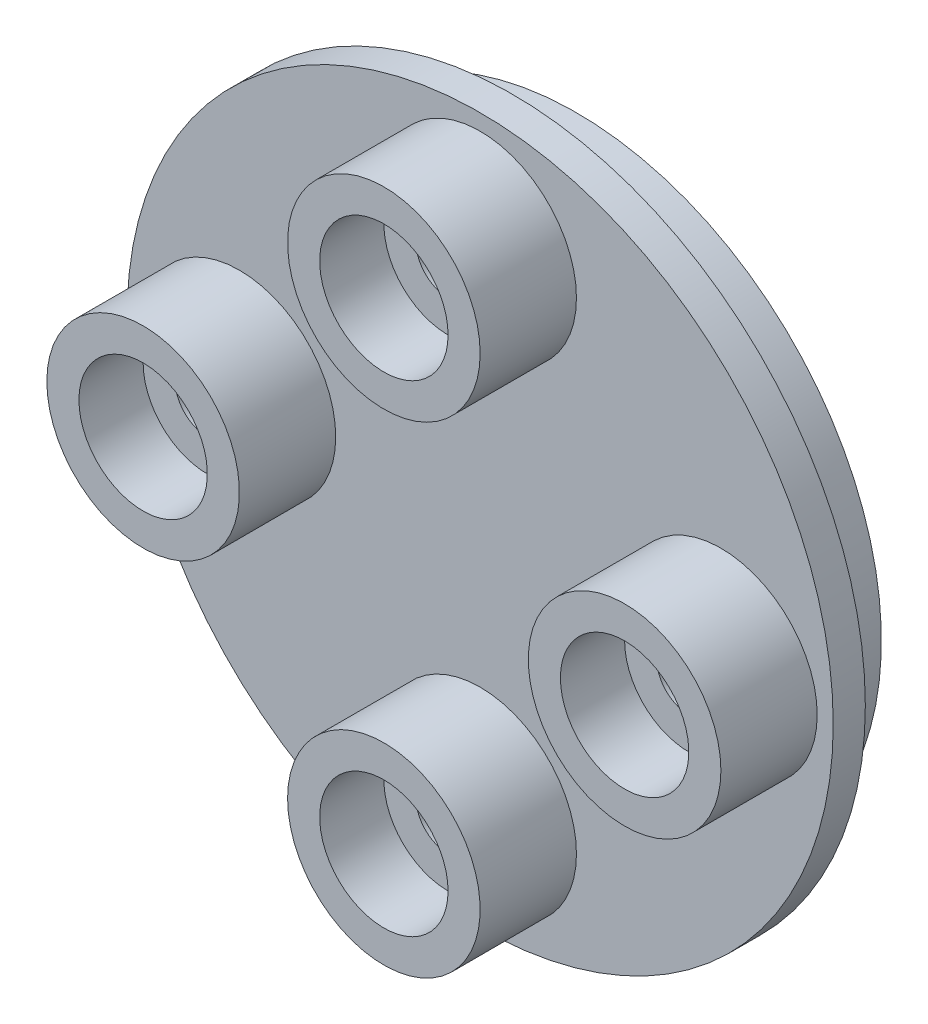
ISO-10303-21;
HEADER;
FILE_DESCRIPTION(('STEP AP214'),'2;1');
FILE_NAME('part.step','',(''),(''),'','','');
FILE_SCHEMA(('AUTOMOTIVE_DESIGN { 1 0 10303 214 1 1 1 1 }'));
ENDSEC;
DATA;
#1=APPLICATION_CONTEXT('core data for automotive mechanical design processes');
#2=APPLICATION_PROTOCOL_DEFINITION('international standard','automotive_design',2000,#1);
#3=PRODUCT_CONTEXT('',#1,'mechanical');
#4=PRODUCT('Part','Part','',(#3));
#5=PRODUCT_RELATED_PRODUCT_CATEGORY('part','',(#4));
#6=PRODUCT_DEFINITION_FORMATION('','',#4);
#7=PRODUCT_DEFINITION_CONTEXT('part definition',#1,'design');
#8=PRODUCT_DEFINITION('design','',#6,#7);
#9=PRODUCT_DEFINITION_SHAPE('','',#8);
#10=(LENGTH_UNIT() NAMED_UNIT(*) SI_UNIT(.MILLI.,.METRE.));
#11=(NAMED_UNIT(*) PLANE_ANGLE_UNIT() SI_UNIT($,.RADIAN.));
#12=(NAMED_UNIT(*) SI_UNIT($,.STERADIAN.) SOLID_ANGLE_UNIT());
#13=UNCERTAINTY_MEASURE_WITH_UNIT(LENGTH_MEASURE(1.E-05),#10,'distance_accuracy_value','');
#14=(GEOMETRIC_REPRESENTATION_CONTEXT(3) GLOBAL_UNCERTAINTY_ASSIGNED_CONTEXT((#13)) GLOBAL_UNIT_ASSIGNED_CONTEXT((#10,
#11,#12)) REPRESENTATION_CONTEXT('',''));
#15=CARTESIAN_POINT('',(0.,0.,0.));
#16=DIRECTION('',(0.,0.,1.));
#17=DIRECTION('',(1.,0.,0.));
#18=AXIS2_PLACEMENT_3D('',#15,#16,#17);
#19=CARTESIAN_POINT('',(0.,7.5,4.));
#20=DIRECTION('',(0.,0.,-1.));
#21=DIRECTION('',(-1.,0.,0.));
#22=AXIS2_PLACEMENT_3D('',#19,#20,#21);
#23=CYLINDRICAL_SURFACE('',#22,3.);
#24=CARTESIAN_POINT('',(0.,7.5,1.));
#25=DIRECTION('',(0.,0.,1.));
#26=DIRECTION('',(1.,0.,0.));
#27=AXIS2_PLACEMENT_3D('',#24,#25,#26);
#28=CIRCLE('',#27,3.);
#29=CARTESIAN_POINT('',(3.,7.5,1.));
#30=VERTEX_POINT('',#29);
#31=EDGE_CURVE('E69',#30,#30,#28,.T.);
#32=ORIENTED_EDGE('',*,*,#31,.T.);
#33=EDGE_LOOP('',(#32));
#34=FACE_BOUND('',#33,.T.);
#35=CARTESIAN_POINT('',(0.,7.5,4.));
#36=DIRECTION('',(0.,0.,1.));
#37=DIRECTION('',(1.,0.,0.));
#38=AXIS2_PLACEMENT_3D('',#35,#36,#37);
#39=CIRCLE('',#38,3.);
#40=CARTESIAN_POINT('',(3.,7.5,4.));
#41=VERTEX_POINT('',#40);
#42=EDGE_CURVE('E58',#41,#41,#39,.T.);
#43=ORIENTED_EDGE('',*,*,#42,.F.);
#44=EDGE_LOOP('',(#43));
#45=FACE_BOUND('',#44,.T.);
#46=ADVANCED_FACE('F38',(#34,#45),#23,.T.);
#47=CARTESIAN_POINT('',(0.,7.5,4.));
#48=DIRECTION('',(0.,0.,1.));
#49=DIRECTION('',(1.,0.,0.));
#50=AXIS2_PLACEMENT_3D('',#47,#48,#49);
#51=PLANE('',#50);
#52=CARTESIAN_POINT('',(0.,7.5,4.));
#53=DIRECTION('',(0.,0.,1.));
#54=DIRECTION('',(1.,0.,0.));
#55=AXIS2_PLACEMENT_3D('',#52,#53,#54);
#56=CIRCLE('',#55,2.);
#57=CARTESIAN_POINT('',(2.,7.5,4.));
#58=VERTEX_POINT('',#57);
#59=EDGE_CURVE('E105',#58,#58,#56,.T.);
#60=ORIENTED_EDGE('',*,*,#59,.F.);
#61=EDGE_LOOP('',(#60));
#62=FACE_BOUND('',#61,.T.);
#63=ORIENTED_EDGE('',*,*,#42,.T.);
#64=EDGE_LOOP('',(#63));
#65=FACE_BOUND('',#64,.T.);
#66=ADVANCED_FACE('F176',(#62,#65),#51,.T.);
#67=CARTESIAN_POINT('',(0.,0.,1.));
#68=DIRECTION('',(0.,0.,-1.));
#69=DIRECTION('',(-1.,0.,0.));
#70=AXIS2_PLACEMENT_3D('',#67,#68,#69);
#71=CYLINDRICAL_SURFACE('',#70,11.);
#72=CARTESIAN_POINT('',(0.,0.,1.));
#73=DIRECTION('',(0.,0.,1.));
#74=DIRECTION('',(1.,0.,0.));
#75=AXIS2_PLACEMENT_3D('',#72,#73,#74);
#76=CIRCLE('',#75,11.);
#77=CARTESIAN_POINT('',(11.,0.,1.));
#78=VERTEX_POINT('',#77);
#79=EDGE_CURVE('E61',#78,#78,#76,.T.);
#80=ORIENTED_EDGE('',*,*,#79,.F.);
#81=EDGE_LOOP('',(#80));
#82=FACE_BOUND('',#81,.T.);
#83=CARTESIAN_POINT('',(0.,0.,0.));
#84=DIRECTION('',(0.,0.,1.));
#85=DIRECTION('',(1.,0.,0.));
#86=AXIS2_PLACEMENT_3D('',#83,#84,#85);
#87=CIRCLE('',#86,11.);
#88=CARTESIAN_POINT('',(11.,0.,0.));
#89=VERTEX_POINT('',#88);
#90=EDGE_CURVE('E62',#89,#89,#87,.T.);
#91=ORIENTED_EDGE('',*,*,#90,.T.);
#92=EDGE_LOOP('',(#91));
#93=FACE_BOUND('',#92,.T.);
#94=ADVANCED_FACE('F182',(#82,#93),#71,.T.);
#95=CARTESIAN_POINT('',(0.,0.,1.));
#96=DIRECTION('',(0.,0.,1.));
#97=DIRECTION('',(1.,0.,0.));
#98=AXIS2_PLACEMENT_3D('',#95,#96,#97);
#99=PLANE('',#98);
#100=CARTESIAN_POINT('',(7.5,0.,1.));
#101=DIRECTION('',(0.,0.,1.));
#102=DIRECTION('',(1.,0.,0.));
#103=AXIS2_PLACEMENT_3D('',#100,#101,#102);
#104=CIRCLE('',#103,3.);
#105=CARTESIAN_POINT('',(10.5,0.,1.));
#106=VERTEX_POINT('',#105);
#107=EDGE_CURVE('E65',#106,#106,#104,.T.);
#108=ORIENTED_EDGE('',*,*,#107,.F.);
#109=EDGE_LOOP('',(#108));
#110=FACE_BOUND('',#109,.T.);
#111=CARTESIAN_POINT('',(0.,-7.5,1.));
#112=DIRECTION('',(0.,0.,1.));
#113=DIRECTION('',(1.,0.,0.));
#114=AXIS2_PLACEMENT_3D('',#111,#112,#113);
#115=CIRCLE('',#114,3.);
#116=CARTESIAN_POINT('',(3.,-7.5,1.));
#117=VERTEX_POINT('',#116);
#118=EDGE_CURVE('E79',#117,#117,#115,.T.);
#119=ORIENTED_EDGE('',*,*,#118,.F.);
#120=EDGE_LOOP('',(#119));
#121=FACE_BOUND('',#120,.T.);
#122=CARTESIAN_POINT('',(-7.5,0.,1.));
#123=DIRECTION('',(0.,0.,1.));
#124=DIRECTION('',(1.,0.,0.));
#125=AXIS2_PLACEMENT_3D('',#122,#123,#124);
#126=CIRCLE('',#125,3.);
#127=CARTESIAN_POINT('',(-4.5,0.,1.));
#128=VERTEX_POINT('',#127);
#129=EDGE_CURVE('E66',#128,#128,#126,.T.);
#130=ORIENTED_EDGE('',*,*,#129,.F.);
#131=EDGE_LOOP('',(#130));
#132=FACE_BOUND('',#131,.T.);
#133=ORIENTED_EDGE('',*,*,#31,.F.);
#134=EDGE_LOOP('',(#133));
#135=FACE_BOUND('',#134,.T.);
#136=ORIENTED_EDGE('',*,*,#79,.T.);
#137=EDGE_LOOP('',(#136));
#138=FACE_BOUND('',#137,.T.);
#139=ADVANCED_FACE('F209',(#110,#121,#132,#135,#138),#99,.T.);
#140=CARTESIAN_POINT('',(0.,7.5,0.));
#141=DIRECTION('',(0.,0.,1.));
#142=DIRECTION('',(1.,0.,0.));
#143=AXIS2_PLACEMENT_3D('',#140,#141,#142);
#144=PLANE('',#143);
#145=CARTESIAN_POINT('',(0.,0.,0.));
#146=DIRECTION('',(0.,0.,1.));
#147=DIRECTION('',(1.,0.,0.));
#148=AXIS2_PLACEMENT_3D('',#145,#146,#147);
#149=CIRCLE('',#148,10.5);
#150=CARTESIAN_POINT('',(10.5,0.,0.));
#151=VERTEX_POINT('',#150);
#152=EDGE_CURVE('E53',#151,#151,#149,.T.);
#153=ORIENTED_EDGE('',*,*,#152,.T.);
#154=EDGE_LOOP('',(#153));
#155=FACE_BOUND('',#154,.T.);
#156=ORIENTED_EDGE('',*,*,#90,.F.);
#157=EDGE_LOOP('',(#156));
#158=FACE_BOUND('',#157,.T.);
#159=ADVANCED_FACE('F187',(#155,#158),#144,.F.);
#160=CARTESIAN_POINT('',(-7.5,0.,4.));
#161=DIRECTION('',(0.,0.,-1.));
#162=DIRECTION('',(-1.,0.,0.));
#163=AXIS2_PLACEMENT_3D('',#160,#161,#162);
#164=CYLINDRICAL_SURFACE('',#163,3.);
#165=ORIENTED_EDGE('',*,*,#129,.T.);
#166=EDGE_LOOP('',(#165));
#167=FACE_BOUND('',#166,.T.);
#168=CARTESIAN_POINT('',(-7.5,0.,4.));
#169=DIRECTION('',(0.,0.,-1.));
#170=DIRECTION('',(-1.,0.,0.));
#171=AXIS2_PLACEMENT_3D('',#168,#169,#170);
#172=CIRCLE('',#171,3.);
#173=CARTESIAN_POINT('',(-10.5,0.,4.));
#174=VERTEX_POINT('',#173);
#175=EDGE_CURVE('E76',#174,#174,#172,.T.);
#176=ORIENTED_EDGE('',*,*,#175,.T.);
#177=EDGE_LOOP('',(#176));
#178=FACE_BOUND('',#177,.T.);
#179=ADVANCED_FACE('F208',(#167,#178),#164,.T.);
#180=CARTESIAN_POINT('',(-7.5,0.,4.));
#181=DIRECTION('',(0.,0.,-1.));
#182=DIRECTION('',(-1.,0.,0.));
#183=AXIS2_PLACEMENT_3D('',#180,#181,#182);
#184=PLANE('',#183);
#185=CARTESIAN_POINT('',(-7.5,0.,4.));
#186=DIRECTION('',(0.,0.,-1.));
#187=DIRECTION('',(-1.,0.,0.));
#188=AXIS2_PLACEMENT_3D('',#185,#186,#187);
#189=CIRCLE('',#188,2.);
#190=CARTESIAN_POINT('',(-9.5,0.,4.));
#191=VERTEX_POINT('',#190);
#192=EDGE_CURVE('E108',#191,#191,#189,.T.);
#193=ORIENTED_EDGE('',*,*,#192,.T.);
#194=EDGE_LOOP('',(#193));
#195=FACE_BOUND('',#194,.T.);
#196=ORIENTED_EDGE('',*,*,#175,.F.);
#197=EDGE_LOOP('',(#196));
#198=FACE_BOUND('',#197,.T.);
#199=ADVANCED_FACE('F222',(#195,#198),#184,.F.);
#200=CARTESIAN_POINT('',(0.,-7.5,4.));
#201=DIRECTION('',(0.,0.,-1.));
#202=DIRECTION('',(-1.,0.,0.));
#203=AXIS2_PLACEMENT_3D('',#200,#201,#202);
#204=CYLINDRICAL_SURFACE('',#203,3.);
#205=ORIENTED_EDGE('',*,*,#118,.T.);
#206=EDGE_LOOP('',(#205));
#207=FACE_BOUND('',#206,.T.);
#208=CARTESIAN_POINT('',(0.,-7.5,4.));
#209=DIRECTION('',(0.,0.,-1.));
#210=DIRECTION('',(-1.,0.,0.));
#211=AXIS2_PLACEMENT_3D('',#208,#209,#210);
#212=CIRCLE('',#211,3.);
#213=CARTESIAN_POINT('',(-3.,-7.5,4.));
#214=VERTEX_POINT('',#213);
#215=EDGE_CURVE('E82',#214,#214,#212,.T.);
#216=ORIENTED_EDGE('',*,*,#215,.T.);
#217=EDGE_LOOP('',(#216));
#218=FACE_BOUND('',#217,.T.);
#219=ADVANCED_FACE('F225',(#207,#218),#204,.T.);
#220=CARTESIAN_POINT('',(0.,-7.5,4.));
#221=DIRECTION('',(0.,0.,-1.));
#222=DIRECTION('',(-1.,0.,0.));
#223=AXIS2_PLACEMENT_3D('',#220,#221,#222);
#224=PLANE('',#223);
#225=CARTESIAN_POINT('',(0.,-7.5,4.));
#226=DIRECTION('',(0.,0.,1.));
#227=DIRECTION('',(1.,0.,0.));
#228=AXIS2_PLACEMENT_3D('',#225,#226,#227);
#229=CIRCLE('',#228,2.00000000000006);
#230=CARTESIAN_POINT('',(2.00000000000006,-7.5,4.));
#231=VERTEX_POINT('',#230);
#232=EDGE_CURVE('E92',#231,#231,#229,.T.);
#233=ORIENTED_EDGE('',*,*,#232,.F.);
#234=EDGE_LOOP('',(#233));
#235=FACE_BOUND('',#234,.T.);
#236=ORIENTED_EDGE('',*,*,#215,.F.);
#237=EDGE_LOOP('',(#236));
#238=FACE_BOUND('',#237,.T.);
#239=ADVANCED_FACE('F230',(#235,#238),#224,.F.);
#240=CARTESIAN_POINT('',(7.5,0.,4.));
#241=DIRECTION('',(0.,0.,-1.));
#242=DIRECTION('',(-1.,0.,0.));
#243=AXIS2_PLACEMENT_3D('',#240,#241,#242);
#244=CYLINDRICAL_SURFACE('',#243,3.);
#245=ORIENTED_EDGE('',*,*,#107,.T.);
#246=EDGE_LOOP('',(#245));
#247=FACE_BOUND('',#246,.T.);
#248=CARTESIAN_POINT('',(7.5,0.,4.));
#249=DIRECTION('',(0.,0.,1.));
#250=DIRECTION('',(1.,0.,0.));
#251=AXIS2_PLACEMENT_3D('',#248,#249,#250);
#252=CIRCLE('',#251,3.);
#253=CARTESIAN_POINT('',(10.5,0.,4.));
#254=VERTEX_POINT('',#253);
#255=EDGE_CURVE('E85',#254,#254,#252,.T.);
#256=ORIENTED_EDGE('',*,*,#255,.F.);
#257=EDGE_LOOP('',(#256));
#258=FACE_BOUND('',#257,.T.);
#259=ADVANCED_FACE('F233',(#247,#258),#244,.T.);
#260=CARTESIAN_POINT('',(7.5,0.,4.));
#261=DIRECTION('',(0.,0.,1.));
#262=DIRECTION('',(1.,0.,0.));
#263=AXIS2_PLACEMENT_3D('',#260,#261,#262);
#264=PLANE('',#263);
#265=CARTESIAN_POINT('',(7.5,0.,4.));
#266=DIRECTION('',(0.,0.,-1.));
#267=DIRECTION('',(-1.,0.,0.));
#268=AXIS2_PLACEMENT_3D('',#265,#266,#267);
#269=CIRCLE('',#268,2.00000000000021);
#270=CARTESIAN_POINT('',(5.49999999999979,0.,4.));
#271=VERTEX_POINT('',#270);
#272=EDGE_CURVE('E99',#271,#271,#269,.T.);
#273=ORIENTED_EDGE('',*,*,#272,.T.);
#274=EDGE_LOOP('',(#273));
#275=FACE_BOUND('',#274,.T.);
#276=ORIENTED_EDGE('',*,*,#255,.T.);
#277=EDGE_LOOP('',(#276));
#278=FACE_BOUND('',#277,.T.);
#279=ADVANCED_FACE('F238',(#275,#278),#264,.T.);
#280=CARTESIAN_POINT('',(7.5,0.,2.));
#281=DIRECTION('',(0.,0.,1.));
#282=DIRECTION('',(1.,0.,0.));
#283=AXIS2_PLACEMENT_3D('',#280,#281,#282);
#284=CYLINDRICAL_SURFACE('',#283,2.00000000000021);
#285=CARTESIAN_POINT('',(7.5,0.,2.));
#286=DIRECTION('',(0.,0.,-1.));
#287=DIRECTION('',(-1.,0.,0.));
#288=AXIS2_PLACEMENT_3D('',#285,#286,#287);
#289=CIRCLE('',#288,2.00000000000021);
#290=CARTESIAN_POINT('',(5.49999999999979,0.,2.));
#291=VERTEX_POINT('',#290);
#292=EDGE_CURVE('E96',#291,#291,#289,.T.);
#293=ORIENTED_EDGE('',*,*,#292,.T.);
#294=EDGE_LOOP('',(#293));
#295=FACE_BOUND('',#294,.T.);
#296=ORIENTED_EDGE('',*,*,#272,.F.);
#297=EDGE_LOOP('',(#296));
#298=FACE_BOUND('',#297,.T.);
#299=ADVANCED_FACE('F241',(#295,#298),#284,.F.);
#300=CARTESIAN_POINT('',(7.5,0.,2.));
#301=DIRECTION('',(0.,0.,-1.));
#302=DIRECTION('',(-1.,0.,0.));
#303=AXIS2_PLACEMENT_3D('',#300,#301,#302);
#304=PLANE('',#303);
#305=CARTESIAN_POINT('',(7.5,0.,2.));
#306=DIRECTION('',(0.,0.,1.));
#307=DIRECTION('',(-1.,0.,0.));
#308=AXIS2_PLACEMENT_3D('',#305,#306,#307);
#309=CIRCLE('',#308,1.);
#310=CARTESIAN_POINT('',(6.5,0.,2.));
#311=VERTEX_POINT('',#310);
#312=EDGE_CURVE('E122',#311,#311,#309,.T.);
#313=ORIENTED_EDGE('',*,*,#312,.F.);
#314=EDGE_LOOP('',(#313));
#315=FACE_BOUND('',#314,.T.);
#316=ORIENTED_EDGE('',*,*,#292,.F.);
#317=EDGE_LOOP('',(#316));
#318=FACE_BOUND('',#317,.T.);
#319=ADVANCED_FACE('F254',(#315,#318),#304,.F.);
#320=CARTESIAN_POINT('',(0.,-7.5,2.));
#321=DIRECTION('',(0.,0.,1.));
#322=DIRECTION('',(1.,0.,0.));
#323=AXIS2_PLACEMENT_3D('',#320,#321,#322);
#324=CYLINDRICAL_SURFACE('',#323,2.00000000000006);
#325=CARTESIAN_POINT('',(0.,-7.5,2.));
#326=DIRECTION('',(0.,0.,1.));
#327=DIRECTION('',(1.,0.,0.));
#328=AXIS2_PLACEMENT_3D('',#325,#326,#327);
#329=CIRCLE('',#328,2.00000000000006);
#330=CARTESIAN_POINT('',(2.00000000000006,-7.5,2.));
#331=VERTEX_POINT('',#330);
#332=EDGE_CURVE('E89',#331,#331,#329,.T.);
#333=ORIENTED_EDGE('',*,*,#332,.F.);
#334=EDGE_LOOP('',(#333));
#335=FACE_BOUND('',#334,.T.);
#336=ORIENTED_EDGE('',*,*,#232,.T.);
#337=EDGE_LOOP('',(#336));
#338=FACE_BOUND('',#337,.T.);
#339=ADVANCED_FACE('F250',(#335,#338),#324,.F.);
#340=CARTESIAN_POINT('',(0.,-7.5,2.));
#341=DIRECTION('',(0.,0.,1.));
#342=DIRECTION('',(1.,0.,0.));
#343=AXIS2_PLACEMENT_3D('',#340,#341,#342);
#344=PLANE('',#343);
#345=CARTESIAN_POINT('',(0.,-7.5,2.));
#346=DIRECTION('',(0.,0.,1.));
#347=DIRECTION('',(1.,0.,0.));
#348=AXIS2_PLACEMENT_3D('',#345,#346,#347);
#349=CIRCLE('',#348,1.);
#350=CARTESIAN_POINT('',(0.999999999999948,-7.5,2.));
#351=VERTEX_POINT('',#350);
#352=EDGE_CURVE('E129',#351,#351,#349,.T.);
#353=ORIENTED_EDGE('',*,*,#352,.F.);
#354=EDGE_LOOP('',(#353));
#355=FACE_BOUND('',#354,.T.);
#356=ORIENTED_EDGE('',*,*,#332,.T.);
#357=EDGE_LOOP('',(#356));
#358=FACE_BOUND('',#357,.T.);
#359=ADVANCED_FACE('F246',(#355,#358),#344,.T.);
#360=CARTESIAN_POINT('',(-7.5,0.,2.));
#361=DIRECTION('',(0.,0.,1.));
#362=DIRECTION('',(1.,0.,0.));
#363=AXIS2_PLACEMENT_3D('',#360,#361,#362);
#364=CYLINDRICAL_SURFACE('',#363,2.);
#365=CARTESIAN_POINT('',(-7.5,0.,2.));
#366=DIRECTION('',(0.,0.,-1.));
#367=DIRECTION('',(-1.,0.,0.));
#368=AXIS2_PLACEMENT_3D('',#365,#366,#367);
#369=CIRCLE('',#368,2.);
#370=CARTESIAN_POINT('',(-9.5,0.,2.));
#371=VERTEX_POINT('',#370);
#372=EDGE_CURVE('E88',#371,#371,#369,.T.);
#373=ORIENTED_EDGE('',*,*,#372,.T.);
#374=EDGE_LOOP('',(#373));
#375=FACE_BOUND('',#374,.T.);
#376=ORIENTED_EDGE('',*,*,#192,.F.);
#377=EDGE_LOOP('',(#376));
#378=FACE_BOUND('',#377,.T.);
#379=ADVANCED_FACE('F249',(#375,#378),#364,.F.);
#380=CARTESIAN_POINT('',(-7.5,0.,2.));
#381=DIRECTION('',(0.,0.,-1.));
#382=DIRECTION('',(-1.,0.,0.));
#383=AXIS2_PLACEMENT_3D('',#380,#381,#382);
#384=PLANE('',#383);
#385=CARTESIAN_POINT('',(-7.5,0.,2.));
#386=DIRECTION('',(0.,0.,1.));
#387=DIRECTION('',(-1.,0.,0.));
#388=AXIS2_PLACEMENT_3D('',#385,#386,#387);
#389=CIRCLE('',#388,1.);
#390=CARTESIAN_POINT('',(-8.5,0.,2.));
#391=VERTEX_POINT('',#390);
#392=EDGE_CURVE('E135',#391,#391,#389,.T.);
#393=ORIENTED_EDGE('',*,*,#392,.F.);
#394=EDGE_LOOP('',(#393));
#395=FACE_BOUND('',#394,.T.);
#396=ORIENTED_EDGE('',*,*,#372,.F.);
#397=EDGE_LOOP('',(#396));
#398=FACE_BOUND('',#397,.T.);
#399=ADVANCED_FACE('F269',(#395,#398),#384,.F.);
#400=CARTESIAN_POINT('',(0.,7.5,2.));
#401=DIRECTION('',(0.,0.,1.));
#402=DIRECTION('',(1.,0.,0.));
#403=AXIS2_PLACEMENT_3D('',#400,#401,#402);
#404=CYLINDRICAL_SURFACE('',#403,2.);
#405=CARTESIAN_POINT('',(0.,7.5,2.));
#406=DIRECTION('',(0.,0.,1.));
#407=DIRECTION('',(1.,0.,0.));
#408=AXIS2_PLACEMENT_3D('',#405,#406,#407);
#409=CIRCLE('',#408,2.);
#410=CARTESIAN_POINT('',(2.,7.5,2.));
#411=VERTEX_POINT('',#410);
#412=EDGE_CURVE('E102',#411,#411,#409,.T.);
#413=ORIENTED_EDGE('',*,*,#412,.F.);
#414=EDGE_LOOP('',(#413));
#415=FACE_BOUND('',#414,.T.);
#416=ORIENTED_EDGE('',*,*,#59,.T.);
#417=EDGE_LOOP('',(#416));
#418=FACE_BOUND('',#417,.T.);
#419=ADVANCED_FACE('F265',(#415,#418),#404,.F.);
#420=CARTESIAN_POINT('',(0.,7.5,2.));
#421=DIRECTION('',(0.,0.,1.));
#422=DIRECTION('',(1.,0.,0.));
#423=AXIS2_PLACEMENT_3D('',#420,#421,#422);
#424=PLANE('',#423);
#425=CARTESIAN_POINT('',(0.,7.5,2.));
#426=DIRECTION('',(0.,0.,1.));
#427=DIRECTION('',(1.,0.,0.));
#428=AXIS2_PLACEMENT_3D('',#425,#426,#427);
#429=CIRCLE('',#428,1.);
#430=CARTESIAN_POINT('',(1.,7.5,2.));
#431=VERTEX_POINT('',#430);
#432=EDGE_CURVE('E141',#431,#431,#429,.T.);
#433=ORIENTED_EDGE('',*,*,#432,.F.);
#434=EDGE_LOOP('',(#433));
#435=FACE_BOUND('',#434,.T.);
#436=ORIENTED_EDGE('',*,*,#412,.T.);
#437=EDGE_LOOP('',(#436));
#438=FACE_BOUND('',#437,.T.);
#439=ADVANCED_FACE('F262',(#435,#438),#424,.T.);
#440=CARTESIAN_POINT('',(0.,0.,0.0001));
#441=DIRECTION('',(0.,0.,-1.));
#442=DIRECTION('',(-1.,0.,0.));
#443=AXIS2_PLACEMENT_3D('',#440,#441,#442);
#444=CYLINDRICAL_SURFACE('',#443,9.5);
#445=CARTESIAN_POINT('',(0.,0.,-1.));
#446=DIRECTION('',(0.,0.,1.));
#447=DIRECTION('',(1.,0.,0.));
#448=AXIS2_PLACEMENT_3D('',#445,#446,#447);
#449=CIRCLE('',#448,9.5);
#450=CARTESIAN_POINT('',(9.5,0.,-1.));
#451=VERTEX_POINT('',#450);
#452=EDGE_CURVE('E49',#451,#451,#449,.F.);
#453=ORIENTED_EDGE('',*,*,#452,.T.);
#454=EDGE_LOOP('',(#453));
#455=FACE_BOUND('',#454,.T.);
#456=CARTESIAN_POINT('',(0.,0.,-2.));
#457=DIRECTION('',(0.,0.,-1.));
#458=DIRECTION('',(-1.,0.,0.));
#459=AXIS2_PLACEMENT_3D('',#456,#457,#458);
#460=CIRCLE('',#459,9.5);
#461=CARTESIAN_POINT('',(-9.5,0.,-2.));
#462=VERTEX_POINT('',#461);
#463=EDGE_CURVE('E93',#462,#462,#460,.T.);
#464=ORIENTED_EDGE('',*,*,#463,.F.);
#465=EDGE_LOOP('',(#464));
#466=FACE_BOUND('',#465,.T.);
#467=ADVANCED_FACE('F200',(#455,#466),#444,.T.);
#468=CARTESIAN_POINT('',(0.,0.,-2.));
#469=DIRECTION('',(0.,0.,-1.));
#470=DIRECTION('',(-1.,0.,0.));
#471=AXIS2_PLACEMENT_3D('',#468,#469,#470);
#472=PLANE('',#471);
#473=CARTESIAN_POINT('',(0.,0.,-2.));
#474=DIRECTION('',(0.,0.,-1.));
#475=DIRECTION('',(-1.,0.,0.));
#476=AXIS2_PLACEMENT_3D('',#473,#474,#475);
#477=CIRCLE('',#476,2.86729540169507);
#478=CARTESIAN_POINT('',(-2.86729540169507,0.,-2.));
#479=VERTEX_POINT('',#478);
#480=EDGE_CURVE('E45',#479,#479,#477,.F.);
#481=ORIENTED_EDGE('',*,*,#480,.T.);
#482=EDGE_LOOP('',(#481));
#483=FACE_BOUND('',#482,.T.);
#484=ORIENTED_EDGE('',*,*,#463,.T.);
#485=EDGE_LOOP('',(#484));
#486=FACE_BOUND('',#485,.T.);
#487=ADVANCED_FACE('F191',(#483,#486),#472,.T.);
#488=CARTESIAN_POINT('',(0.,0.,-1.));
#489=DIRECTION('',(0.,0.,1.));
#490=DIRECTION('',(1.,0.,0.));
#491=AXIS2_PLACEMENT_3D('',#488,#489,#490);
#492=TOROIDAL_SURFACE('',#491,10.5,1.);
#493=ORIENTED_EDGE('',*,*,#452,.F.);
#494=EDGE_LOOP('',(#493));
#495=FACE_BOUND('',#494,.T.);
#496=ORIENTED_EDGE('',*,*,#152,.F.);
#497=EDGE_LOOP('',(#496));
#498=FACE_BOUND('',#497,.T.);
#499=ADVANCED_FACE('F188',(#495,#498),#492,.F.);
#500=CARTESIAN_POINT('',(7.5,0.,-0.5));
#501=DIRECTION('',(0.,0.,1.));
#502=DIRECTION('',(1.,0.,0.));
#503=AXIS2_PLACEMENT_3D('',#500,#501,#502);
#504=CYLINDRICAL_SURFACE('',#503,1.);
#505=CARTESIAN_POINT('',(7.5,0.,-0.5));
#506=DIRECTION('',(0.,0.,1.));
#507=DIRECTION('',(-1.,0.,0.));
#508=AXIS2_PLACEMENT_3D('',#505,#506,#507);
#509=CIRCLE('',#508,1.);
#510=CARTESIAN_POINT('',(6.5,0.,-0.5));
#511=VERTEX_POINT('',#510);
#512=EDGE_CURVE('E125',#511,#511,#509,.T.);
#513=ORIENTED_EDGE('',*,*,#512,.F.);
#514=EDGE_LOOP('',(#513));
#515=FACE_BOUND('',#514,.T.);
#516=ORIENTED_EDGE('',*,*,#312,.T.);
#517=EDGE_LOOP('',(#516));
#518=FACE_BOUND('',#517,.T.);
#519=ADVANCED_FACE('F190',(#515,#518),#504,.F.);
#520=CARTESIAN_POINT('',(0.,-7.5,-0.5));
#521=DIRECTION('',(0.,0.,1.));
#522=DIRECTION('',(1.,0.,0.));
#523=AXIS2_PLACEMENT_3D('',#520,#521,#522);
#524=CYLINDRICAL_SURFACE('',#523,1.);
#525=CARTESIAN_POINT('',(0.,-7.5,-0.5));
#526=DIRECTION('',(0.,0.,1.));
#527=DIRECTION('',(1.,0.,0.));
#528=AXIS2_PLACEMENT_3D('',#525,#526,#527);
#529=CIRCLE('',#528,1.);
#530=CARTESIAN_POINT('',(0.999999999999948,-7.5,-0.5));
#531=VERTEX_POINT('',#530);
#532=EDGE_CURVE('E132',#531,#531,#529,.T.);
#533=ORIENTED_EDGE('',*,*,#532,.F.);
#534=EDGE_LOOP('',(#533));
#535=FACE_BOUND('',#534,.T.);
#536=ORIENTED_EDGE('',*,*,#352,.T.);
#537=EDGE_LOOP('',(#536));
#538=FACE_BOUND('',#537,.T.);
#539=ADVANCED_FACE('F197',(#535,#538),#524,.F.);
#540=CARTESIAN_POINT('',(-7.5,0.,-0.5));
#541=DIRECTION('',(0.,0.,1.));
#542=DIRECTION('',(1.,0.,0.));
#543=AXIS2_PLACEMENT_3D('',#540,#541,#542);
#544=CYLINDRICAL_SURFACE('',#543,1.);
#545=CARTESIAN_POINT('',(-7.5,0.,-0.5));
#546=DIRECTION('',(0.,0.,1.));
#547=DIRECTION('',(-1.,0.,0.));
#548=AXIS2_PLACEMENT_3D('',#545,#546,#547);
#549=CIRCLE('',#548,1.);
#550=CARTESIAN_POINT('',(-8.5,0.,-0.5));
#551=VERTEX_POINT('',#550);
#552=EDGE_CURVE('E138',#551,#551,#549,.T.);
#553=ORIENTED_EDGE('',*,*,#552,.F.);
#554=EDGE_LOOP('',(#553));
#555=FACE_BOUND('',#554,.T.);
#556=ORIENTED_EDGE('',*,*,#392,.T.);
#557=EDGE_LOOP('',(#556));
#558=FACE_BOUND('',#557,.T.);
#559=ADVANCED_FACE('F290',(#555,#558),#544,.F.);
#560=CARTESIAN_POINT('',(0.,7.5,-0.5));
#561=DIRECTION('',(0.,0.,1.));
#562=DIRECTION('',(1.,0.,0.));
#563=AXIS2_PLACEMENT_3D('',#560,#561,#562);
#564=CYLINDRICAL_SURFACE('',#563,1.);
#565=CARTESIAN_POINT('',(0.,7.5,-0.5));
#566=DIRECTION('',(0.,0.,1.));
#567=DIRECTION('',(1.,0.,0.));
#568=AXIS2_PLACEMENT_3D('',#565,#566,#567);
#569=CIRCLE('',#568,1.);
#570=CARTESIAN_POINT('',(1.,7.5,-0.5));
#571=VERTEX_POINT('',#570);
#572=EDGE_CURVE('E119',#571,#571,#569,.T.);
#573=ORIENTED_EDGE('',*,*,#572,.F.);
#574=EDGE_LOOP('',(#573));
#575=FACE_BOUND('',#574,.T.);
#576=ORIENTED_EDGE('',*,*,#432,.T.);
#577=EDGE_LOOP('',(#576));
#578=FACE_BOUND('',#577,.T.);
#579=ADVANCED_FACE('F282',(#575,#578),#564,.F.);
#580=CARTESIAN_POINT('',(0.,0.,-0.5));
#581=DIRECTION('',(0.,0.,-1.));
#582=DIRECTION('',(-1.,0.,0.));
#583=AXIS2_PLACEMENT_3D('',#580,#581,#582);
#584=CYLINDRICAL_SURFACE('',#583,9.);
#585=CARTESIAN_POINT('',(0.,0.,-0.5));
#586=DIRECTION('',(0.,0.,-1.));
#587=DIRECTION('',(-1.,0.,0.));
#588=AXIS2_PLACEMENT_3D('',#585,#586,#587);
#589=CIRCLE('',#588,9.);
#590=CARTESIAN_POINT('',(-9.,0.,-0.5));
#591=VERTEX_POINT('',#590);
#592=EDGE_CURVE('E115',#591,#591,#589,.T.);
#593=ORIENTED_EDGE('',*,*,#592,.F.);
#594=EDGE_LOOP('',(#593));
#595=FACE_BOUND('',#594,.T.);
#596=CARTESIAN_POINT('',(0.,0.,-1.5));
#597=DIRECTION('',(0.,0.,-1.));
#598=DIRECTION('',(-1.,0.,0.));
#599=AXIS2_PLACEMENT_3D('',#596,#597,#598);
#600=CIRCLE('',#599,9.);
#601=CARTESIAN_POINT('',(-9.,0.,-1.5));
#602=VERTEX_POINT('',#601);
#603=EDGE_CURVE('E116',#602,#602,#600,.T.);
#604=ORIENTED_EDGE('',*,*,#603,.T.);
#605=EDGE_LOOP('',(#604));
#606=FACE_BOUND('',#605,.T.);
#607=ADVANCED_FACE('F280',(#595,#606),#584,.F.);
#608=CARTESIAN_POINT('',(0.,0.,-0.5));
#609=DIRECTION('',(0.,0.,-1.));
#610=DIRECTION('',(-1.,0.,0.));
#611=AXIS2_PLACEMENT_3D('',#608,#609,#610);
#612=PLANE('',#611);
#613=ORIENTED_EDGE('',*,*,#572,.T.);
#614=EDGE_LOOP('',(#613));
#615=FACE_BOUND('',#614,.T.);
#616=ORIENTED_EDGE('',*,*,#552,.T.);
#617=EDGE_LOOP('',(#616));
#618=FACE_BOUND('',#617,.T.);
#619=ORIENTED_EDGE('',*,*,#532,.T.);
#620=EDGE_LOOP('',(#619));
#621=FACE_BOUND('',#620,.T.);
#622=ORIENTED_EDGE('',*,*,#512,.T.);
#623=EDGE_LOOP('',(#622));
#624=FACE_BOUND('',#623,.T.);
#625=ORIENTED_EDGE('',*,*,#592,.T.);
#626=EDGE_LOOP('',(#625));
#627=FACE_BOUND('',#626,.T.);
#628=ADVANCED_FACE('F171',(#615,#618,#621,#624,#627),#612,.T.);
#629=CARTESIAN_POINT('',(0.,0.,-1.5));
#630=DIRECTION('',(0.,0.,-1.));
#631=DIRECTION('',(-1.,0.,0.));
#632=AXIS2_PLACEMENT_3D('',#629,#630,#631);
#633=PLANE('',#632);
#634=CARTESIAN_POINT('',(0.,0.,-1.5));
#635=DIRECTION('',(0.,0.,-1.));
#636=DIRECTION('',(-1.,0.,0.));
#637=AXIS2_PLACEMENT_3D('',#634,#635,#636);
#638=CIRCLE('',#637,1.);
#639=CARTESIAN_POINT('',(-1.,0.,-1.5));
#640=VERTEX_POINT('',#639);
#641=EDGE_CURVE('E148',#640,#640,#638,.F.);
#642=ORIENTED_EDGE('',*,*,#641,.F.);
#643=EDGE_LOOP('',(#642));
#644=FACE_BOUND('',#643,.T.);
#645=ORIENTED_EDGE('',*,*,#603,.F.);
#646=EDGE_LOOP('',(#645));
#647=FACE_BOUND('',#646,.T.);
#648=ADVANCED_FACE('F166',(#644,#647),#633,.F.);
#649=CARTESIAN_POINT('',(0.,0.,-5.5));
#650=DIRECTION('',(0.,0.,1.));
#651=DIRECTION('',(1.,0.,0.));
#652=AXIS2_PLACEMENT_3D('',#649,#650,#651);
#653=CONICAL_SURFACE('',#652,1.5,0.141897054604164);
#654=CARTESIAN_POINT('',(0.,0.,-2.85857864376269));
#655=DIRECTION('',(0.,0.,-1.));
#656=DIRECTION('',(-1.,0.,0.));
#657=AXIS2_PLACEMENT_3D('',#654,#655,#656);
#658=CIRCLE('',#657,1.8773459080339);
#659=CARTESIAN_POINT('',(-1.8773459080339,0.,-2.85857864376269));
#660=VERTEX_POINT('',#659);
#661=EDGE_CURVE('E10',#660,#660,#658,.T.);
#662=ORIENTED_EDGE('',*,*,#661,.T.);
#663=EDGE_LOOP('',(#662));
#664=FACE_BOUND('',#663,.T.);
#665=CARTESIAN_POINT('',(0.,0.,-5.5));
#666=DIRECTION('',(0.,0.,1.));
#667=DIRECTION('',(1.,0.,0.));
#668=AXIS2_PLACEMENT_3D('',#665,#666,#667);
#669=CIRCLE('',#668,1.5);
#670=CARTESIAN_POINT('',(1.5,0.,-5.5));
#671=VERTEX_POINT('',#670);
#672=EDGE_CURVE('E126',#671,#671,#669,.T.);
#673=ORIENTED_EDGE('',*,*,#672,.T.);
#674=EDGE_LOOP('',(#673));
#675=FACE_BOUND('',#674,.T.);
#676=ADVANCED_FACE('F161',(#664,#675),#653,.T.);
#677=CARTESIAN_POINT('',(0.,1.5,-5.5));
#678=DIRECTION('',(0.,0.,1.));
#679=DIRECTION('',(1.,0.,0.));
#680=AXIS2_PLACEMENT_3D('',#677,#678,#679);
#681=PLANE('',#680);
#682=CARTESIAN_POINT('',(0.,0.,-5.5));
#683=DIRECTION('',(0.,0.,-1.));
#684=DIRECTION('',(-1.,0.,0.));
#685=AXIS2_PLACEMENT_3D('',#682,#683,#684);
#686=CIRCLE('',#685,1.);
#687=CARTESIAN_POINT('',(-1.,0.,-5.5));
#688=VERTEX_POINT('',#687);
#689=EDGE_CURVE('E151',#688,#688,#686,.T.);
#690=ORIENTED_EDGE('',*,*,#689,.F.);
#691=EDGE_LOOP('',(#690));
#692=FACE_BOUND('',#691,.T.);
#693=ORIENTED_EDGE('',*,*,#672,.F.);
#694=EDGE_LOOP('',(#693));
#695=FACE_BOUND('',#694,.T.);
#696=ADVANCED_FACE('F158',(#692,#695),#681,.F.);
#697=CARTESIAN_POINT('',(0.,0.,-5.5));
#698=DIRECTION('',(0.,0.,1.));
#699=DIRECTION('',(1.,0.,0.));
#700=AXIS2_PLACEMENT_3D('',#697,#698,#699);
#701=CYLINDRICAL_SURFACE('',#700,1.);
#702=ORIENTED_EDGE('',*,*,#689,.T.);
#703=EDGE_LOOP('',(#702));
#704=FACE_BOUND('',#703,.T.);
#705=ORIENTED_EDGE('',*,*,#641,.T.);
#706=EDGE_LOOP('',(#705));
#707=FACE_BOUND('',#706,.T.);
#708=ADVANCED_FACE('F155',(#704,#707),#701,.F.);
#709=CARTESIAN_POINT('',(0.,0.,-3.));
#710=DIRECTION('',(0.,0.,-1.));
#711=DIRECTION('',(-1.,0.,0.));
#712=AXIS2_PLACEMENT_3D('',#709,#710,#711);
#713=TOROIDAL_SURFACE('',#712,2.86729540169507,1.);
#714=ORIENTED_EDGE('',*,*,#661,.F.);
#715=EDGE_LOOP('',(#714));
#716=FACE_BOUND('',#715,.T.);
#717=ORIENTED_EDGE('',*,*,#480,.F.);
#718=EDGE_LOOP('',(#717));
#719=FACE_BOUND('',#718,.T.);
#720=ADVANCED_FACE('F40',(#716,#719),#713,.F.);
#721=CLOSED_SHELL('',(#46,#66,#94,#139,#159,#179,#199,#219,#239,#259,#279,#299,#319,#339,#359,
#379,#399,#419,#439,#467,#487,#499,#519,#539,#559,#579,#607,#628,#648,#676,#696,#708,#720));
#722=MANIFOLD_SOLID_BREP('B2',#721);
#723=ADVANCED_BREP_SHAPE_REPRESENTATION('',(#18,#722),#14);
#724=SHAPE_DEFINITION_REPRESENTATION(#9,#723);
ENDSEC;
END-ISO-10303-21;
